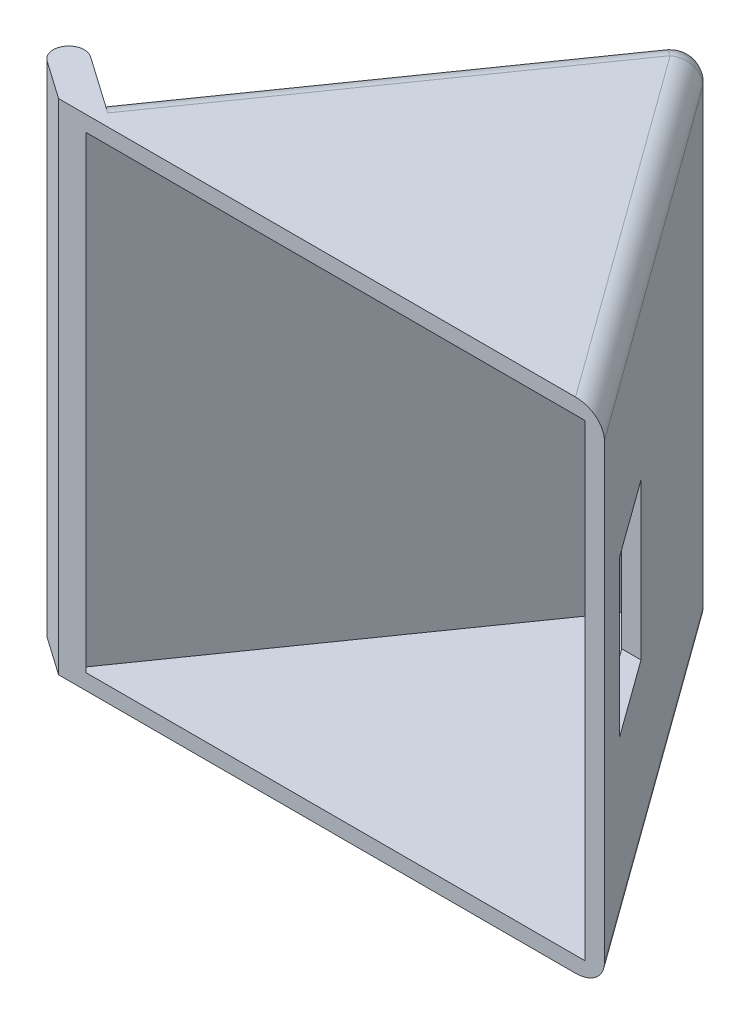
ISO-10303-21;
HEADER;
FILE_DESCRIPTION(('STEP AP214'),'2;1');
FILE_NAME('part.step','',(''),(''),'','','');
FILE_SCHEMA(('AUTOMOTIVE_DESIGN { 1 0 10303 214 1 1 1 1 }'));
ENDSEC;
DATA;
#1=APPLICATION_CONTEXT('core data for automotive mechanical design processes');
#2=APPLICATION_PROTOCOL_DEFINITION('international standard','automotive_design',2000,#1);
#3=PRODUCT_CONTEXT('',#1,'mechanical');
#4=PRODUCT('Part','Part','',(#3));
#5=PRODUCT_RELATED_PRODUCT_CATEGORY('part','',(#4));
#6=PRODUCT_DEFINITION_FORMATION('','',#4);
#7=PRODUCT_DEFINITION_CONTEXT('part definition',#1,'design');
#8=PRODUCT_DEFINITION('design','',#6,#7);
#9=PRODUCT_DEFINITION_SHAPE('','',#8);
#10=(LENGTH_UNIT() NAMED_UNIT(*) SI_UNIT(.MILLI.,.METRE.));
#11=(NAMED_UNIT(*) PLANE_ANGLE_UNIT() SI_UNIT($,.RADIAN.));
#12=(NAMED_UNIT(*) SI_UNIT($,.STERADIAN.) SOLID_ANGLE_UNIT());
#13=UNCERTAINTY_MEASURE_WITH_UNIT(LENGTH_MEASURE(1.E-05),#10,'distance_accuracy_value','');
#14=(GEOMETRIC_REPRESENTATION_CONTEXT(3) GLOBAL_UNCERTAINTY_ASSIGNED_CONTEXT((#13)) GLOBAL_UNIT_ASSIGNED_CONTEXT((#10,
#11,#12)) REPRESENTATION_CONTEXT('',''));
#15=CARTESIAN_POINT('',(0.,0.,0.));
#16=DIRECTION('',(0.,0.,1.));
#17=DIRECTION('',(1.,0.,0.));
#18=AXIS2_PLACEMENT_3D('',#15,#16,#17);
#19=CARTESIAN_POINT('',(35.,32.,0.));
#20=DIRECTION('',(-0.809983847848433,0.,0.586452185795778));
#21=DIRECTION('',(0.586452185795778,0.,0.809983847848434));
#22=AXIS2_PLACEMENT_3D('',#19,#20,#21);
#23=PLANE('',#22);
#24=DIRECTION('',(0.,-1.,0.));
#25=VECTOR('',#24,1.);
#26=CARTESIAN_POINT('',(35.,32.,0.));
#27=LINE('',#26,#25);
#28=CARTESIAN_POINT('',(35.,30.5,0.));
#29=VERTEX_POINT('',#28);
#30=CARTESIAN_POINT('',(35.,1.5,0.));
#31=VERTEX_POINT('',#30);
#32=EDGE_CURVE('E278',#29,#31,#27,.T.);
#33=ORIENTED_EDGE('',*,*,#32,.T.);
#34=DIRECTION('',(-0.586452185795778,0.,-0.809983847848434));
#35=VECTOR('',#34,1.);
#36=CARTESIAN_POINT('',(17.2072930905315,1.5,-24.5745613286697));
#37=LINE('',#36,#35);
#38=CARTESIAN_POINT('',(18.4427069673902,1.5,-22.868258052972));
#39=VERTEX_POINT('',#38);
#40=EDGE_CURVE('E394',#31,#39,#37,.T.);
#41=ORIENTED_EDGE('',*,*,#40,.T.);
#42=DIRECTION('',(0.,-1.,0.));
#43=VECTOR('',#42,1.);
#44=CARTESIAN_POINT('',(18.4427069673903,32.,-22.868258052972));
#45=LINE('',#44,#43);
#46=CARTESIAN_POINT('',(18.4427069673902,30.5,-22.868258052972));
#47=VERTEX_POINT('',#46);
#48=EDGE_CURVE('E390',#39,#47,#45,.F.);
#49=ORIENTED_EDGE('',*,*,#48,.T.);
#50=DIRECTION('',(-0.586452185795778,0.,-0.809983847848434));
#51=VECTOR('',#50,1.);
#52=CARTESIAN_POINT('',(35.,30.5,0.));
#53=LINE('',#52,#51);
#54=EDGE_CURVE('E392',#47,#29,#53,.F.);
#55=ORIENTED_EDGE('',*,*,#54,.T.);
#56=EDGE_LOOP('',(#33,#41,#49,#55));
#57=FACE_BOUND('',#56,.T.);
#58=DIRECTION('',(-0.586452185795778,0.,-0.809983847848434));
#59=VECTOR('',#58,1.);
#60=CARTESIAN_POINT('',(39.940453386454,21.,6.82355278230528));
#61=LINE('',#60,#59);
#62=CARTESIAN_POINT('',(32.4658968129581,21.,-3.5));
#63=VERTEX_POINT('',#62);
#64=CARTESIAN_POINT('',(28.8457494028981,21.,-8.50000000000001));
#65=VERTEX_POINT('',#64);
#66=EDGE_CURVE('E219',#63,#65,#61,.T.);
#67=ORIENTED_EDGE('',*,*,#66,.T.);
#68=DIRECTION('',(0.,-1.,0.));
#69=VECTOR('',#68,1.);
#70=CARTESIAN_POINT('',(28.8457494028981,32.,-8.5));
#71=LINE('',#70,#69);
#72=CARTESIAN_POINT('',(28.8457494028981,11.,-8.5));
#73=VERTEX_POINT('',#72);
#74=EDGE_CURVE('E222',#65,#73,#71,.T.);
#75=ORIENTED_EDGE('',*,*,#74,.T.);
#76=DIRECTION('',(0.586452185795778,0.,0.809983847848434));
#77=VECTOR('',#76,1.);
#78=CARTESIAN_POINT('',(39.940453386454,11.,6.82355278230527));
#79=LINE('',#78,#77);
#80=CARTESIAN_POINT('',(32.4658968129581,11.,-3.5));
#81=VERTEX_POINT('',#80);
#82=EDGE_CURVE('E190',#73,#81,#79,.T.);
#83=ORIENTED_EDGE('',*,*,#82,.T.);
#84=DIRECTION('',(0.,1.,0.));
#85=VECTOR('',#84,1.);
#86=CARTESIAN_POINT('',(32.4658968129581,32.,-3.5));
#87=LINE('',#86,#85);
#88=EDGE_CURVE('E247',#81,#63,#87,.T.);
#89=ORIENTED_EDGE('',*,*,#88,.T.);
#90=EDGE_LOOP('',(#67,#75,#83,#89));
#91=FACE_BOUND('',#90,.T.);
#92=ADVANCED_FACE('F35',(#57,#91),#23,.F.);
#93=CARTESIAN_POINT('',(34.1900161521516,32.,0.586452185795778));
#94=DIRECTION('',(-0.809983847848433,0.,0.586452185795778));
#95=DIRECTION('',(0.586452185795778,0.,0.809983847848434));
#96=AXIS2_PLACEMENT_3D('',#93,#94,#95);
#97=PLANE('',#96);
#98=DIRECTION('',(-0.586452185795778,0.,-0.809983847848434));
#99=VECTOR('',#98,1.);
#100=CARTESIAN_POINT('',(22.152600334289,1.,-16.0391357452538));
#101=LINE('',#100,#99);
#102=CARTESIAN_POINT('',(33.7654074798451,1.,0.));
#103=VERTEX_POINT('',#102);
#104=CARTESIAN_POINT('',(17.2209184939222,1.,-22.8505736257421));
#105=VERTEX_POINT('',#104);
#106=EDGE_CURVE('E231',#103,#105,#101,.T.);
#107=ORIENTED_EDGE('',*,*,#106,.F.);
#108=DIRECTION('',(0.,-1.,0.));
#109=VECTOR('',#108,1.);
#110=CARTESIAN_POINT('',(33.7654074798451,32.,0.));
#111=LINE('',#110,#109);
#112=CARTESIAN_POINT('',(33.7654074798451,31.,0.));
#113=VERTEX_POINT('',#112);
#114=EDGE_CURVE('E235',#113,#103,#111,.T.);
#115=ORIENTED_EDGE('',*,*,#114,.F.);
#116=DIRECTION('',(-0.586452185795778,0.,-0.809983847848434));
#117=VECTOR('',#116,1.);
#118=CARTESIAN_POINT('',(22.152600334289,31.,-16.0391357452538));
#119=LINE('',#118,#117);
#120=CARTESIAN_POINT('',(17.2209184939222,31.,-22.8505736257421));
#121=VERTEX_POINT('',#120);
#122=EDGE_CURVE('E236',#113,#121,#119,.T.);
#123=ORIENTED_EDGE('',*,*,#122,.T.);
#124=DIRECTION('',(0.,-1.,0.));
#125=VECTOR('',#124,1.);
#126=CARTESIAN_POINT('',(17.2209184939222,32.,-22.8505736257421));
#127=LINE('',#126,#125);
#128=EDGE_CURVE('E232',#121,#105,#127,.T.);
#129=ORIENTED_EDGE('',*,*,#128,.T.);
#130=EDGE_LOOP('',(#107,#115,#123,#129));
#131=FACE_BOUND('',#130,.T.);
#132=DIRECTION('',(0.,1.,0.));
#133=VECTOR('',#132,1.);
#134=CARTESIAN_POINT('',(27.6111568827432,32.,-8.5));
#135=LINE('',#134,#133);
#136=CARTESIAN_POINT('',(27.6111568827432,11.,-8.5));
#137=VERTEX_POINT('',#136);
#138=CARTESIAN_POINT('',(27.6111568827432,21.,-8.50000000000001));
#139=VERTEX_POINT('',#138);
#140=EDGE_CURVE('E197',#137,#139,#135,.T.);
#141=ORIENTED_EDGE('',*,*,#140,.T.);
#142=DIRECTION('',(0.586452185795778,0.,0.809983847848434));
#143=VECTOR('',#142,1.);
#144=CARTESIAN_POINT('',(34.1900161521516,21.,0.586452185795783));
#145=LINE('',#144,#143);
#146=CARTESIAN_POINT('',(31.2313042928031,21.,-3.50000000000001));
#147=VERTEX_POINT('',#146);
#148=EDGE_CURVE('E203',#139,#147,#145,.T.);
#149=ORIENTED_EDGE('',*,*,#148,.T.);
#150=DIRECTION('',(0.,-1.,0.));
#151=VECTOR('',#150,1.);
#152=CARTESIAN_POINT('',(31.2313042928031,32.,-3.5));
#153=LINE('',#152,#151);
#154=CARTESIAN_POINT('',(31.2313042928031,11.,-3.5));
#155=VERTEX_POINT('',#154);
#156=EDGE_CURVE('E208',#147,#155,#153,.T.);
#157=ORIENTED_EDGE('',*,*,#156,.T.);
#158=DIRECTION('',(-0.586452185795778,0.,-0.809983847848434));
#159=VECTOR('',#158,1.);
#160=CARTESIAN_POINT('',(34.1900161521516,11.,0.586452185795778));
#161=LINE('',#160,#159);
#162=EDGE_CURVE('E187',#155,#137,#161,.T.);
#163=ORIENTED_EDGE('',*,*,#162,.T.);
#164=EDGE_LOOP('',(#141,#149,#157,#163));
#165=FACE_BOUND('',#164,.T.);
#166=ADVANCED_FACE('F206',(#131,#165),#97,.T.);
#167=CARTESIAN_POINT('',(0.,32.,0.));
#168=DIRECTION('',(0.,0.,-1.));
#169=DIRECTION('',(-1.,0.,0.));
#170=AXIS2_PLACEMENT_3D('',#167,#168,#169);
#171=PLANE('',#170);
#172=DIRECTION('',(1.,0.,0.));
#173=VECTOR('',#172,1.);
#174=CARTESIAN_POINT('',(0.,0.,0.));
#175=LINE('',#174,#173);
#176=CARTESIAN_POINT('',(0.,0.,0.));
#177=VERTEX_POINT('',#176);
#178=CARTESIAN_POINT('',(33.1481112197676,0.,0.));
#179=VERTEX_POINT('',#178);
#180=EDGE_CURVE('E275',#177,#179,#175,.T.);
#181=ORIENTED_EDGE('',*,*,#180,.T.);
#182=CARTESIAN_POINT('',(33.1481112197676,1.5,0.));
#183=DIRECTION('',(0.,0.,-1.));
#184=DIRECTION('',(1.,0.,0.));
#185=AXIS2_PLACEMENT_3D('',#182,#183,#184);
#186=ELLIPSE('',#185,1.85188878023242,1.5);
#187=EDGE_CURVE('E398',#179,#31,#186,.F.);
#188=ORIENTED_EDGE('',*,*,#187,.T.);
#189=ORIENTED_EDGE('',*,*,#32,.F.);
#190=CARTESIAN_POINT('',(33.1481112197676,30.5,0.));
#191=DIRECTION('',(0.,0.,-1.));
#192=DIRECTION('',(-1.,0.,0.));
#193=AXIS2_PLACEMENT_3D('',#190,#191,#192);
#194=ELLIPSE('',#193,1.85188878023242,1.5);
#195=CARTESIAN_POINT('',(33.1481112197676,32.,0.));
#196=VERTEX_POINT('',#195);
#197=EDGE_CURVE('E396',#29,#196,#194,.F.);
#198=ORIENTED_EDGE('',*,*,#197,.T.);
#199=DIRECTION('',(1.,0.,0.));
#200=VECTOR('',#199,1.);
#201=CARTESIAN_POINT('',(0.,32.,0.));
#202=LINE('',#201,#200);
#203=CARTESIAN_POINT('',(0.,32.,0.));
#204=VERTEX_POINT('',#203);
#205=EDGE_CURVE('E276',#204,#196,#202,.T.);
#206=ORIENTED_EDGE('',*,*,#205,.F.);
#207=DIRECTION('',(0.,-1.,0.));
#208=VECTOR('',#207,1.);
#209=CARTESIAN_POINT('',(0.,32.,0.));
#210=LINE('',#209,#208);
#211=EDGE_CURVE('E283',#204,#177,#210,.T.);
#212=ORIENTED_EDGE('',*,*,#211,.T.);
#213=EDGE_LOOP('',(#181,#188,#189,#198,#206,#212));
#214=FACE_BOUND('',#213,.T.);
#215=DIRECTION('',(1.,0.,0.));
#216=VECTOR('',#215,1.);
#217=CARTESIAN_POINT('',(0.,1.,0.));
#218=LINE('',#217,#216);
#219=CARTESIAN_POINT('',(1.74344679562108,1.,0.));
#220=VERTEX_POINT('',#219);
#221=EDGE_CURVE('E239',#220,#103,#218,.T.);
#222=ORIENTED_EDGE('',*,*,#221,.F.);
#223=DIRECTION('',(0.,-1.,0.));
#224=VECTOR('',#223,1.);
#225=CARTESIAN_POINT('',(1.74344679562108,32.,0.));
#226=LINE('',#225,#224);
#227=CARTESIAN_POINT('',(1.74344679562108,31.,0.));
#228=VERTEX_POINT('',#227);
#229=EDGE_CURVE('E250',#228,#220,#226,.T.);
#230=ORIENTED_EDGE('',*,*,#229,.F.);
#231=DIRECTION('',(1.,0.,0.));
#232=VECTOR('',#231,1.);
#233=CARTESIAN_POINT('',(0.,31.,0.));
#234=LINE('',#233,#232);
#235=EDGE_CURVE('E230',#228,#113,#234,.T.);
#236=ORIENTED_EDGE('',*,*,#235,.T.);
#237=ORIENTED_EDGE('',*,*,#114,.T.);
#238=EDGE_LOOP('',(#222,#230,#236,#237));
#239=FACE_BOUND('',#238,.T.);
#240=ADVANCED_FACE('F340',(#214,#239),#171,.F.);
#241=CARTESIAN_POINT('',(-2.12945530445384,32.,-3.93260983398219));
#242=DIRECTION('',(-0.573576436351053,0.,0.819152044288987));
#243=DIRECTION('',(0.819152044288987,0.,0.573576436351053));
#244=AXIS2_PLACEMENT_3D('',#241,#242,#243);
#245=PLANE('',#244);
#246=DIRECTION('',(-0.819152044288987,0.,-0.573576436351053));
#247=VECTOR('',#246,1.);
#248=CARTESIAN_POINT('',(2.97883252764019,17.,-0.355748186604935));
#249=LINE('',#248,#247);
#250=CARTESIAN_POINT('',(1.1471528727021,17.,-1.63830408857797));
#251=VERTEX_POINT('',#250);
#252=CARTESIAN_POINT('',(-1.31030326016486,17.,-3.35903339763113));
#253=VERTEX_POINT('',#252);
#254=EDGE_CURVE('E259',#251,#253,#249,.T.);
#255=ORIENTED_EDGE('',*,*,#254,.T.);
#256=DIRECTION('',(0.,-1.,0.));
#257=VECTOR('',#256,1.);
#258=CARTESIAN_POINT('',(-1.31030326016486,32.,-3.35903339763113));
#259=LINE('',#258,#257);
#260=CARTESIAN_POINT('',(-1.31030326016486,32.,-3.35903339763113));
#261=VERTEX_POINT('',#260);
#262=EDGE_CURVE('E364',#253,#261,#259,.F.);
#263=ORIENTED_EDGE('',*,*,#262,.T.);
#264=DIRECTION('',(-0.819152044288987,0.,-0.573576436351053));
#265=VECTOR('',#264,1.);
#266=CARTESIAN_POINT('',(-2.12945530445384,32.,-3.93260983398219));
#267=LINE('',#266,#265);
#268=CARTESIAN_POINT('',(2.37588093913558,32.,-0.777939434051399));
#269=VERTEX_POINT('',#268);
#270=EDGE_CURVE('E59',#269,#261,#267,.T.);
#271=ORIENTED_EDGE('',*,*,#270,.F.);
#272=CARTESIAN_POINT('',(2.37588093913558,30.5,-0.777939434051399));
#273=DIRECTION('',(-0.573576436351053,0.,0.819152044288987));
#274=DIRECTION('',(0.819152044288987,0.,0.573576436351053));
#275=AXIS2_PLACEMENT_3D('',#272,#273,#274);
#276=CIRCLE('',#275,1.5);
#277=CARTESIAN_POINT('',(1.1471528727021,30.5,-1.63830408857798));
#278=VERTEX_POINT('',#277);
#279=EDGE_CURVE('E11',#269,#278,#276,.T.);
#280=ORIENTED_EDGE('',*,*,#279,.T.);
#281=DIRECTION('',(0.,-1.,0.));
#282=VECTOR('',#281,1.);
#283=CARTESIAN_POINT('',(1.1471528727021,32.,-1.63830408857798));
#284=LINE('',#283,#282);
#285=EDGE_CURVE('E273',#278,#251,#284,.T.);
#286=ORIENTED_EDGE('',*,*,#285,.T.);
#287=EDGE_LOOP('',(#255,#263,#271,#280,#286));
#288=FACE_BOUND('',#287,.T.);
#289=ADVANCED_FACE('F329',(#288),#245,.F.);
#290=CARTESIAN_POINT('',(17.2072930905315,32.,-24.5745613286697));
#291=DIRECTION('',(0.819152044288989,0.,0.57357643635105));
#292=DIRECTION('',(0.57357643635105,0.,-0.819152044288989));
#293=AXIS2_PLACEMENT_3D('',#290,#291,#292);
#294=PLANE('',#293);
#295=CARTESIAN_POINT('',(14.9129873451273,16.,-21.2979531515137));
#296=DIRECTION('',(-0.819152044288989,0.,-0.57357643635105));
#297=DIRECTION('',(-0.57357643635105,0.,0.819152044288989));
#298=AXIS2_PLACEMENT_3D('',#295,#296,#297);
#299=CIRCLE('',#298,1.);
#300=CARTESIAN_POINT('',(14.3394109087763,16.,-20.4788011072247));
#301=VERTEX_POINT('',#300);
#302=EDGE_CURVE('E210',#301,#301,#299,.T.);
#303=ORIENTED_EDGE('',*,*,#302,.F.);
#304=EDGE_LOOP('',(#303));
#305=FACE_BOUND('',#304,.T.);
#306=DIRECTION('',(0.,-1.,0.));
#307=VECTOR('',#306,1.);
#308=CARTESIAN_POINT('',(15.9990031291841,32.,-22.8489444288049));
#309=LINE('',#308,#307);
#310=CARTESIAN_POINT('',(15.9990031291841,30.5,-22.8489444288049));
#311=VERTEX_POINT('',#310);
#312=CARTESIAN_POINT('',(15.9990031291841,1.5,-22.8489444288049));
#313=VERTEX_POINT('',#312);
#314=EDGE_CURVE('E379',#311,#313,#309,.T.);
#315=ORIENTED_EDGE('',*,*,#314,.T.);
#316=DIRECTION('',(-0.57357643635105,0.,0.819152044288989));
#317=VECTOR('',#316,1.);
#318=CARTESIAN_POINT('',(1.1471528727021,1.5,-1.63830408857798));
#319=LINE('',#318,#317);
#320=CARTESIAN_POINT('',(1.1471528727021,1.5,-1.63830408857798));
#321=VERTEX_POINT('',#320);
#322=EDGE_CURVE('E383',#313,#321,#319,.T.);
#323=ORIENTED_EDGE('',*,*,#322,.T.);
#324=CARTESIAN_POINT('',(1.1471528727021,15.,-1.63830408857797));
#325=VERTEX_POINT('',#324);
#326=EDGE_CURVE('E269',#325,#321,#284,.T.);
#327=ORIENTED_EDGE('',*,*,#326,.F.);
#328=CARTESIAN_POINT('',(1.1471528727021,16.,-1.63830408857798));
#329=DIRECTION('',(0.819152044288989,0.,0.57357643635105));
#330=DIRECTION('',(0.57357643635105,0.,-0.819152044288989));
#331=AXIS2_PLACEMENT_3D('',#328,#329,#330);
#332=CIRCLE('',#331,1.);
#333=EDGE_CURVE('E256',#325,#251,#332,.F.);
#334=ORIENTED_EDGE('',*,*,#333,.T.);
#335=ORIENTED_EDGE('',*,*,#285,.F.);
#336=DIRECTION('',(-0.57357643635105,0.,0.819152044288989));
#337=VECTOR('',#336,1.);
#338=CARTESIAN_POINT('',(17.2072930905315,30.5,-24.5745613286697));
#339=LINE('',#338,#337);
#340=EDGE_CURVE('E381',#278,#311,#339,.F.);
#341=ORIENTED_EDGE('',*,*,#340,.T.);
#342=EDGE_LOOP('',(#315,#323,#327,#334,#335,#341));
#343=FACE_BOUND('',#342,.T.);
#344=ADVANCED_FACE('F333',(#305,#343),#294,.F.);
#345=CARTESIAN_POINT('',(0.,32.,0.));
#346=DIRECTION('',(0.,-1.,0.));
#347=DIRECTION('',(0.,0.,-1.));
#348=AXIS2_PLACEMENT_3D('',#345,#346,#347);
#349=PLANE('',#348);
#350=ORIENTED_EDGE('',*,*,#205,.T.);
#351=DIRECTION('',(-0.586452185795778,0.,-0.809983847848434));
#352=VECTOR('',#351,1.);
#353=CARTESIAN_POINT('',(21.7476084103648,32.,-15.7459096523559));
#354=LINE('',#353,#352);
#355=CARTESIAN_POINT('',(17.2277311956176,32.,-21.9885797742783));
#356=VERTEX_POINT('',#355);
#357=EDGE_CURVE('E52',#196,#356,#354,.T.);
#358=ORIENTED_EDGE('',*,*,#357,.T.);
#359=DIRECTION('',(-0.57357643635105,0.,0.819152044288989));
#360=VECTOR('',#359,1.);
#361=CARTESIAN_POINT('',(1.22872806643348,32.,0.860364654526575));
#362=LINE('',#361,#360);
#363=EDGE_CURVE('E400',#356,#269,#362,.T.);
#364=ORIENTED_EDGE('',*,*,#363,.T.);
#365=ORIENTED_EDGE('',*,*,#270,.T.);
#366=CARTESIAN_POINT('',(-1.88387969651591,32.,-2.53988135334215));
#367=DIRECTION('',(0.,-1.,0.));
#368=DIRECTION('',(0.,0.,-1.));
#369=AXIS2_PLACEMENT_3D('',#366,#367,#368);
#370=CIRCLE('',#369,1.);
#371=CARTESIAN_POINT('',(-2.70303174080489,32.,-3.1134577896932));
#372=VERTEX_POINT('',#371);
#373=EDGE_CURVE('E363',#261,#372,#370,.F.);
#374=ORIENTED_EDGE('',*,*,#373,.T.);
#375=CARTESIAN_POINT('',(-1.88387969651591,32.,-2.53988135334215));
#376=DIRECTION('',(0.,-1.,0.));
#377=DIRECTION('',(0.,0.,-1.));
#378=AXIS2_PLACEMENT_3D('',#375,#376,#377);
#379=CIRCLE('',#378,1.);
#380=CARTESIAN_POINT('',(-2.45745613286696,32.,-1.72072930905316));
#381=VERTEX_POINT('',#380);
#382=EDGE_CURVE('E377',#372,#381,#379,.F.);
#383=ORIENTED_EDGE('',*,*,#382,.T.);
#384=DIRECTION('',(0.819152044288987,0.,0.573576436351053));
#385=VECTOR('',#384,1.);
#386=CARTESIAN_POINT('',(0.,32.,0.));
#387=LINE('',#386,#385);
#388=EDGE_CURVE('E266',#381,#204,#387,.T.);
#389=ORIENTED_EDGE('',*,*,#388,.T.);
#390=EDGE_LOOP('',(#350,#358,#364,#365,#374,#383,#389));
#391=FACE_BOUND('',#390,.T.);
#392=ADVANCED_FACE('F330',(#391),#349,.F.);
#393=CARTESIAN_POINT('',(0.,0.,0.));
#394=DIRECTION('',(0.,-1.,0.));
#395=DIRECTION('',(0.,0.,-1.));
#396=AXIS2_PLACEMENT_3D('',#393,#394,#395);
#397=PLANE('',#396);
#398=DIRECTION('',(-0.819152044288987,0.,-0.573576436351053));
#399=VECTOR('',#398,1.);
#400=CARTESIAN_POINT('',(-2.12945530445384,0.,-3.93260983398219));
#401=LINE('',#400,#399);
#402=CARTESIAN_POINT('',(2.37588093913558,0.,-0.777939434051399));
#403=VERTEX_POINT('',#402);
#404=CARTESIAN_POINT('',(-1.31030326016486,0.,-3.35903339763113));
#405=VERTEX_POINT('',#404);
#406=EDGE_CURVE('E264',#403,#405,#401,.T.);
#407=ORIENTED_EDGE('',*,*,#406,.F.);
#408=DIRECTION('',(-0.57357643635105,0.,0.819152044288989));
#409=VECTOR('',#408,1.);
#410=CARTESIAN_POINT('',(18.436021156965,0.,-23.7141966741431));
#411=LINE('',#410,#409);
#412=CARTESIAN_POINT('',(17.2277311956176,0.,-21.9885797742783));
#413=VERTEX_POINT('',#412);
#414=EDGE_CURVE('E388',#403,#413,#411,.F.);
#415=ORIENTED_EDGE('',*,*,#414,.T.);
#416=DIRECTION('',(-0.586452185795778,0.,-0.809983847848434));
#417=VECTOR('',#416,1.);
#418=CARTESIAN_POINT('',(33.7850242282274,0.,0.879678278693668));
#419=LINE('',#418,#417);
#420=EDGE_CURVE('E386',#413,#179,#419,.F.);
#421=ORIENTED_EDGE('',*,*,#420,.T.);
#422=ORIENTED_EDGE('',*,*,#180,.F.);
#423=DIRECTION('',(0.819152044288987,0.,0.573576436351053));
#424=VECTOR('',#423,1.);
#425=CARTESIAN_POINT('',(0.,0.,0.));
#426=LINE('',#425,#424);
#427=CARTESIAN_POINT('',(-2.45745613286696,0.,-1.72072930905316));
#428=VERTEX_POINT('',#427);
#429=EDGE_CURVE('E267',#428,#177,#426,.T.);
#430=ORIENTED_EDGE('',*,*,#429,.F.);
#431=CARTESIAN_POINT('',(-1.88387969651591,0.,-2.53988135334215));
#432=DIRECTION('',(0.,-1.,0.));
#433=DIRECTION('',(0.,0.,-1.));
#434=AXIS2_PLACEMENT_3D('',#431,#432,#433);
#435=CIRCLE('',#434,1.);
#436=CARTESIAN_POINT('',(-2.70303174080489,0.,-3.1134577896932));
#437=VERTEX_POINT('',#436);
#438=EDGE_CURVE('E375',#428,#437,#435,.T.);
#439=ORIENTED_EDGE('',*,*,#438,.T.);
#440=CARTESIAN_POINT('',(-1.88387969651591,0.,-2.53988135334215));
#441=DIRECTION('',(0.,-1.,0.));
#442=DIRECTION('',(0.,0.,-1.));
#443=AXIS2_PLACEMENT_3D('',#440,#441,#442);
#444=CIRCLE('',#443,1.);
#445=EDGE_CURVE('E366',#437,#405,#444,.T.);
#446=ORIENTED_EDGE('',*,*,#445,.T.);
#447=EDGE_LOOP('',(#407,#415,#421,#422,#430,#439,#446));
#448=FACE_BOUND('',#447,.T.);
#449=ADVANCED_FACE('F327',(#448),#397,.T.);
#450=ORIENTED_EDGE('',*,*,#406,.T.);
#451=DIRECTION('',(0.,-1.,0.));
#452=VECTOR('',#451,1.);
#453=CARTESIAN_POINT('',(-1.31030326016486,32.,-3.35903339763113));
#454=LINE('',#453,#452);
#455=CARTESIAN_POINT('',(-1.31030326016486,15.,-3.35903339763113));
#456=VERTEX_POINT('',#455);
#457=EDGE_CURVE('E368',#405,#456,#454,.F.);
#458=ORIENTED_EDGE('',*,*,#457,.T.);
#459=DIRECTION('',(-0.819152044288987,0.,-0.573576436351053));
#460=VECTOR('',#459,1.);
#461=CARTESIAN_POINT('',(2.97883252764019,15.,-0.355748186604935));
#462=LINE('',#461,#460);
#463=EDGE_CURVE('E254',#325,#456,#462,.T.);
#464=ORIENTED_EDGE('',*,*,#463,.F.);
#465=ORIENTED_EDGE('',*,*,#326,.T.);
#466=CARTESIAN_POINT('',(2.37588093913558,1.5,-0.777939434051401));
#467=DIRECTION('',(-0.573576436351053,0.,0.819152044288987));
#468=DIRECTION('',(0.819152044288987,0.,0.573576436351053));
#469=AXIS2_PLACEMENT_3D('',#466,#467,#468);
#470=CIRCLE('',#469,1.5);
#471=EDGE_CURVE('E44',#321,#403,#470,.T.);
#472=ORIENTED_EDGE('',*,*,#471,.T.);
#473=EDGE_LOOP('',(#450,#458,#464,#465,#472));
#474=FACE_BOUND('',#473,.T.);
#475=ADVANCED_FACE('F323',(#474),#245,.F.);
#476=CARTESIAN_POINT('',(0.,32.,0.));
#477=DIRECTION('',(0.573576436351053,0.,-0.819152044288987));
#478=DIRECTION('',(-0.819152044288987,0.,-0.573576436351053));
#479=AXIS2_PLACEMENT_3D('',#476,#477,#478);
#480=PLANE('',#479);
#481=ORIENTED_EDGE('',*,*,#388,.F.);
#482=DIRECTION('',(0.,-1.,0.));
#483=VECTOR('',#482,1.);
#484=CARTESIAN_POINT('',(-2.45745613286696,32.,-1.72072930905316));
#485=LINE('',#484,#483);
#486=EDGE_CURVE('E372',#381,#428,#485,.T.);
#487=ORIENTED_EDGE('',*,*,#486,.T.);
#488=ORIENTED_EDGE('',*,*,#429,.T.);
#489=ORIENTED_EDGE('',*,*,#211,.F.);
#490=EDGE_LOOP('',(#481,#487,#488,#489));
#491=FACE_BOUND('',#490,.T.);
#492=ADVANCED_FACE('F317',(#491),#480,.F.);
#493=CARTESIAN_POINT('',(2.9788325276402,16.,-0.355748186604938));
#494=DIRECTION('',(-0.819152044288987,0.,-0.573576436351053));
#495=DIRECTION('',(-0.573576436351053,0.,0.819152044288987));
#496=AXIS2_PLACEMENT_3D('',#493,#494,#495);
#497=CYLINDRICAL_SURFACE('',#496,1.);
#498=CARTESIAN_POINT('',(-1.31030326016486,15.,-3.35903339763113));
#499=CARTESIAN_POINT('',(-1.33310550711178,15.0000084726861,-3.37500282200134));
#500=CARTESIAN_POINT('',(-1.35657637251984,15.00000021537,-3.39001508960939));
#501=CARTESIAN_POINT('',(-1.40468719113877,15.0000119302077,-3.41803177932073));
#502=CARTESIAN_POINT('',(-1.42932713723116,15.0000319021896,-3.43103621364757));
#503=CARTESIAN_POINT('',(-1.47965246595902,15.000161877896,-3.45496492544329));
#504=CARTESIAN_POINT('',(-1.50533961104606,15.0002720399026,-3.46588550419685));
#505=CARTESIAN_POINT('',(-1.55752665630268,15.0007051556566,-3.48554108292495));
#506=CARTESIAN_POINT('',(-1.58402654595227,15.0010281066508,-3.49427611117542));
#507=CARTESIAN_POINT('',(-1.66452940311665,15.0025463105821,-3.51711787557564));
#508=CARTESIAN_POINT('',(-1.71952649529518,15.0042909948775,-3.52785699114539));
#509=CARTESIAN_POINT('',(-1.83031010061858,15.0109521102541,-3.53999767943296));
#510=CARTESIAN_POINT('',(-1.88609584585694,15.0158656393623,-3.54140778221018));
#511=CARTESIAN_POINT('',(-1.9943166929152,15.0306663007788,-3.5351809721169));
#512=CARTESIAN_POINT('',(-2.04679758569917,15.0403518073493,-3.52789505127447));
#513=CARTESIAN_POINT('',(-2.14835355787017,15.0664010018036,-3.50566813657277));
#514=CARTESIAN_POINT('',(-2.1974337447676,15.082754409152,-3.4907389180929));
#515=CARTESIAN_POINT('',(-2.28361138106778,15.1205265775903,-3.45751688712231));
#516=CARTESIAN_POINT('',(-2.32143050845834,15.1409526814356,-3.43995866608425));
#517=CARTESIAN_POINT('',(-2.39171932631304,15.1877558294031,-3.40225600100022));
#518=CARTESIAN_POINT('',(-2.42418878399193,15.2141331323671,-3.38211144448041));
#519=CARTESIAN_POINT('',(-2.481524438486,15.2706641697465,-3.34235938750421));
#520=CARTESIAN_POINT('',(-2.50672196340715,15.3005109096799,-3.32278830106969));
#521=CARTESIAN_POINT('',(-2.55196416085023,15.3643811864625,-3.28455686710211));
#522=CARTESIAN_POINT('',(-2.57200759223279,15.3984057264442,-3.26589673980875));
#523=CARTESIAN_POINT('',(-2.60905013168161,15.4734075698069,-3.22899646799235));
#524=CARTESIAN_POINT('',(-2.62555229846989,15.5147396942126,-3.2109802661849));
#525=CARTESIAN_POINT('',(-2.65342605759434,15.6005374802068,-3.17882719034967));
#526=CARTESIAN_POINT('',(-2.66479336859886,15.645005721042,-3.16469355735678));
#527=CARTESIAN_POINT('',(-2.68385471601058,15.7404323667975,-3.14013797780963));
#528=CARTESIAN_POINT('',(-2.69109920108987,15.7916066781811,-3.13019400460062));
#529=CARTESIAN_POINT('',(-2.69828757226715,15.8692769087492,-3.12018665251485));
#530=CARTESIAN_POINT('',(-2.70007062650894,15.8953230973099,-3.11766895895148));
#531=CARTESIAN_POINT('',(-2.70244047454774,15.9475756022013,-3.11430330094861));
#532=CARTESIAN_POINT('',(-2.70302734645708,15.9737819079639,-3.11345522748079));
#533=CARTESIAN_POINT('',(-2.7030317408049,16.,-3.1134577896932));
#534=B_SPLINE_CURVE_WITH_KNOTS('',3,(#498,#499,#500,#501,#502,#503,#504,#505,#506,#507,#508,
#509,#510,#511,#512,#513,#514,#515,#516,#517,#518,#519,#520,#521,#522,#523,#524,#525,#526,#527,
#528,#529,#530,#531,#532,#533),.UNSPECIFIED.,.F.,.F.,(4,2,2,2,2,2,2,2,2,2,2,2,2,2,2,2,2,4),(0.,
0.0834878347281737,0.166975161167903,0.250609321497255,0.334242399739241,0.50153827508288,
0.668681160903593,0.829299803909303,0.989671736729569,1.12821123604275,1.26675676216527,
1.39728229603103,1.52783923192528,1.671304684928,1.81488953652532,1.97206569111012,
2.05068136863726,2.12929191228916),.UNSPECIFIED.);
#535=CARTESIAN_POINT('',(-2.7030317408049,16.,-3.1134577896932));
#536=VERTEX_POINT('',#535);
#537=EDGE_CURVE('E292',#456,#536,#534,.T.);
#538=ORIENTED_EDGE('',*,*,#537,.T.);
#539=CARTESIAN_POINT('',(-2.70303174080489,16.,-3.1134577896932));
#540=CARTESIAN_POINT('',(-2.70302626591719,16.0278381927218,-3.1134508369657));
#541=CARTESIAN_POINT('',(-2.70236481013221,16.0556750830582,-3.11440988991785));
#542=CARTESIAN_POINT('',(-2.69969077741958,16.1111548715253,-3.11820838021012));
#543=CARTESIAN_POINT('',(-2.69767820871779,16.138797770836,-3.1210478061021));
#544=CARTESIAN_POINT('',(-2.69225802951019,16.1937468119812,-3.1285620185049));
#545=CARTESIAN_POINT('',(-2.68884797169065,16.2210522760356,-3.1332400241854));
#546=CARTESIAN_POINT('',(-2.68055927290026,16.2750753776442,-3.1443223985679));
#547=CARTESIAN_POINT('',(-2.675680650931,16.3017930227994,-3.15072674493284));
#548=CARTESIAN_POINT('',(-2.65868450059395,16.3808386006414,-3.17235285537999));
#549=CARTESIAN_POINT('',(-2.64420758329949,16.4320492847674,-3.18998627171365));
#550=CARTESIAN_POINT('',(-2.60800868424276,16.5297615142646,-3.23007035698915));
#551=CARTESIAN_POINT('',(-2.58629334008808,16.5762673232447,-3.25251660588055));
#552=CARTESIAN_POINT('',(-2.53564013556573,16.661345099804,-3.29905271323444));
#553=CARTESIAN_POINT('',(-2.50701728487684,16.7001558979018,-3.32304421499877));
#554=CARTESIAN_POINT('',(-2.44182490811678,16.7705968455897,-3.37073319332362));
#555=CARTESIAN_POINT('',(-2.40526765566626,16.8022379330876,-3.39443106490373));
#556=CARTESIAN_POINT('',(-2.33036568360688,16.8537751459025,-3.43554840097404));
#557=CARTESIAN_POINT('',(-2.29294182150335,16.874683779566,-3.45338338974567));
#558=CARTESIAN_POINT('',(-2.21376415593598,16.9106356481225,-3.4848620166553));
#559=CARTESIAN_POINT('',(-2.17201016417988,16.9256786278166,-3.49850547242547));
#560=CARTESIAN_POINT('',(-2.08816243918084,16.949844403228,-3.51969357778055));
#561=CARTESIAN_POINT('',(-2.04622828647929,16.9592594932656,-3.52754555127903));
#562=CARTESIAN_POINT('',(-1.96106169319821,16.9743910821375,-3.53782162232236));
#563=CARTESIAN_POINT('',(-1.91782894270176,16.9801066906143,-3.54024441356623));
#564=CARTESIAN_POINT('',(-1.82686695042167,16.9892850361206,-3.53938987805403));
#565=CARTESIAN_POINT('',(-1.77911576360433,16.9924691509512,-3.53552528047547));
#566=CARTESIAN_POINT('',(-1.68455714174592,16.9968597510647,-3.5209851127399));
#567=CARTESIAN_POINT('',(-1.63775052521288,16.9980645882673,-3.5103038768528));
#568=CARTESIAN_POINT('',(-1.54177325349387,16.9995942281573,-3.48100234639162));
#569=CARTESIAN_POINT('',(-1.49279820995887,16.9998249342035,-3.46172626799624));
#570=CARTESIAN_POINT('',(-1.42210766263587,16.9999733218018,-3.42726891765205));
#571=CARTESIAN_POINT('',(-1.39900233811174,16.9999898246271,-3.41485659683198));
#572=CARTESIAN_POINT('',(-1.35383859377962,17.0000006283695,-3.3882576460609));
#573=CARTESIAN_POINT('',(-1.33178010570369,16.9999949307363,-3.37407113203134));
#574=CARTESIAN_POINT('',(-1.31030326016485,17.,-3.35903339763113));
#575=B_SPLINE_CURVE_WITH_KNOTS('',3,(#539,#540,#541,#542,#543,#544,#545,#546,#547,#548,#549,
#550,#551,#552,#553,#554,#555,#556,#557,#558,#559,#560,#561,#562,#563,#564,#565,#566,#567,#568,
#569,#570,#571,#572,#573,#574),.UNSPECIFIED.,.F.,.F.,(4,2,2,2,2,2,2,2,2,2,2,2,2,2,2,2,2,4),(0.,
0.083487834728174,0.166975161167903,0.250609321497249,0.334242399739241,0.501538275082879,
0.668681160903592,0.829299803909305,0.989671736729567,1.12821123604275,1.26675676216527,
1.39728229603103,1.52783923192528,1.671304684928,1.81488953652532,1.97206569111011,
2.05068136863726,2.12929191228916),.UNSPECIFIED.);
#576=EDGE_CURVE('E301',#536,#253,#575,.T.);
#577=ORIENTED_EDGE('',*,*,#576,.T.);
#578=ORIENTED_EDGE('',*,*,#254,.F.);
#579=ORIENTED_EDGE('',*,*,#333,.F.);
#580=ORIENTED_EDGE('',*,*,#463,.T.);
#581=EDGE_LOOP('',(#538,#577,#578,#579,#580));
#582=FACE_BOUND('',#581,.T.);
#583=ADVANCED_FACE('F311',(#582),#497,.F.);
#584=CARTESIAN_POINT('',(0.573576436351053,32.,-0.819152044288987));
#585=DIRECTION('',(0.573576436351053,0.,-0.819152044288987));
#586=DIRECTION('',(-0.819152044288987,0.,-0.573576436351053));
#587=AXIS2_PLACEMENT_3D('',#584,#585,#586);
#588=PLANE('',#587);
#589=DIRECTION('',(0.,-1.,0.));
#590=VECTOR('',#589,1.);
#591=CARTESIAN_POINT('',(1.39272848064004,32.,-0.245575607937937));
#592=LINE('',#591,#590);
#593=CARTESIAN_POINT('',(1.39272848064004,31.,-0.245575607937936));
#594=VERTEX_POINT('',#593);
#595=CARTESIAN_POINT('',(1.39272848064004,1.,-0.245575607937934));
#596=VERTEX_POINT('',#595);
#597=EDGE_CURVE('E223',#594,#596,#592,.T.);
#598=ORIENTED_EDGE('',*,*,#597,.F.);
#599=DIRECTION('',(0.819152044288987,0.,0.573576436351053));
#600=VECTOR('',#599,1.);
#601=CARTESIAN_POINT('',(0.573576436351053,31.,-0.819152044288987));
#602=LINE('',#601,#600);
#603=EDGE_CURVE('E226',#594,#228,#602,.T.);
#604=ORIENTED_EDGE('',*,*,#603,.T.);
#605=ORIENTED_EDGE('',*,*,#229,.T.);
#606=DIRECTION('',(0.819152044288987,0.,0.573576436351053));
#607=VECTOR('',#606,1.);
#608=CARTESIAN_POINT('',(0.573576436351053,1.,-0.819152044288987));
#609=LINE('',#608,#607);
#610=EDGE_CURVE('E244',#596,#220,#609,.T.);
#611=ORIENTED_EDGE('',*,*,#610,.F.);
#612=EDGE_LOOP('',(#598,#604,#605,#611));
#613=FACE_BOUND('',#612,.T.);
#614=ADVANCED_FACE('F316',(#613),#588,.T.);
#615=CARTESIAN_POINT('',(18.0264451348205,32.,-24.0009848923186));
#616=DIRECTION('',(0.819152044288989,0.,0.57357643635105));
#617=DIRECTION('',(0.57357643635105,0.,-0.819152044288989));
#618=AXIS2_PLACEMENT_3D('',#615,#616,#617);
#619=PLANE('',#618);
#620=CARTESIAN_POINT('',(15.7321393894163,16.,-20.7243767151627));
#621=DIRECTION('',(0.819152044288989,0.,0.57357643635105));
#622=DIRECTION('',(0.57357643635105,0.,-0.819152044288989));
#623=AXIS2_PLACEMENT_3D('',#620,#621,#622);
#624=CIRCLE('',#623,1.);
#625=CARTESIAN_POINT('',(16.3057158257674,16.,-21.5435287594517));
#626=VERTEX_POINT('',#625);
#627=EDGE_CURVE('E422',#626,#626,#624,.F.);
#628=ORIENTED_EDGE('',*,*,#627,.T.);
#629=EDGE_LOOP('',(#628));
#630=FACE_BOUND('',#629,.T.);
#631=DIRECTION('',(-0.57357643635105,0.,0.819152044288989));
#632=VECTOR('',#631,1.);
#633=CARTESIAN_POINT('',(0.819152044288991,1.,0.573576436351052));
#634=LINE('',#633,#632);
#635=EDGE_CURVE('E225',#105,#596,#634,.T.);
#636=ORIENTED_EDGE('',*,*,#635,.F.);
#637=ORIENTED_EDGE('',*,*,#128,.F.);
#638=DIRECTION('',(-0.57357643635105,0.,0.819152044288989));
#639=VECTOR('',#638,1.);
#640=CARTESIAN_POINT('',(0.819152044288991,31.,0.573576436351052));
#641=LINE('',#640,#639);
#642=EDGE_CURVE('E227',#121,#594,#641,.T.);
#643=ORIENTED_EDGE('',*,*,#642,.T.);
#644=ORIENTED_EDGE('',*,*,#597,.T.);
#645=EDGE_LOOP('',(#636,#637,#643,#644));
#646=FACE_BOUND('',#645,.T.);
#647=ADVANCED_FACE('F453',(#630,#646),#619,.T.);
#648=CARTESIAN_POINT('',(0.,31.,0.));
#649=DIRECTION('',(0.,-1.,0.));
#650=DIRECTION('',(0.,0.,-1.));
#651=AXIS2_PLACEMENT_3D('',#648,#649,#650);
#652=PLANE('',#651);
#653=ORIENTED_EDGE('',*,*,#642,.F.);
#654=ORIENTED_EDGE('',*,*,#122,.F.);
#655=ORIENTED_EDGE('',*,*,#235,.F.);
#656=ORIENTED_EDGE('',*,*,#603,.F.);
#657=EDGE_LOOP('',(#653,#654,#655,#656));
#658=FACE_BOUND('',#657,.T.);
#659=ADVANCED_FACE('F446',(#658),#652,.T.);
#660=CARTESIAN_POINT('',(0.,1.,0.));
#661=DIRECTION('',(0.,-1.,0.));
#662=DIRECTION('',(0.,0.,-1.));
#663=AXIS2_PLACEMENT_3D('',#660,#661,#662);
#664=PLANE('',#663);
#665=ORIENTED_EDGE('',*,*,#635,.T.);
#666=ORIENTED_EDGE('',*,*,#610,.T.);
#667=ORIENTED_EDGE('',*,*,#221,.T.);
#668=ORIENTED_EDGE('',*,*,#106,.T.);
#669=EDGE_LOOP('',(#665,#666,#667,#668));
#670=FACE_BOUND('',#669,.T.);
#671=ADVANCED_FACE('F439',(#670),#664,.F.);
#672=CARTESIAN_POINT('',(48.554882427627,21.,0.586452185795783));
#673=DIRECTION('',(0.,-1.,0.));
#674=DIRECTION('',(0.,0.,-1.));
#675=AXIS2_PLACEMENT_3D('',#672,#673,#674);
#676=PLANE('',#675);
#677=DIRECTION('',(-1.,0.,0.));
#678=VECTOR('',#677,1.);
#679=CARTESIAN_POINT('',(45.5961705682785,21.,-3.50000000000001));
#680=LINE('',#679,#678);
#681=EDGE_CURVE('E215',#63,#147,#680,.T.);
#682=ORIENTED_EDGE('',*,*,#681,.T.);
#683=ORIENTED_EDGE('',*,*,#148,.F.);
#684=DIRECTION('',(-1.,0.,0.));
#685=VECTOR('',#684,1.);
#686=CARTESIAN_POINT('',(41.9760231582185,21.,-8.50000000000001));
#687=LINE('',#686,#685);
#688=EDGE_CURVE('E194',#65,#139,#687,.T.);
#689=ORIENTED_EDGE('',*,*,#688,.F.);
#690=ORIENTED_EDGE('',*,*,#66,.F.);
#691=EDGE_LOOP('',(#682,#683,#689,#690));
#692=FACE_BOUND('',#691,.T.);
#693=ADVANCED_FACE('F437',(#692),#676,.T.);
#694=CARTESIAN_POINT('',(41.9760231582185,32.,-8.5));
#695=DIRECTION('',(0.,0.,1.));
#696=DIRECTION('',(1.,0.,0.));
#697=AXIS2_PLACEMENT_3D('',#694,#695,#696);
#698=PLANE('',#697);
#699=ORIENTED_EDGE('',*,*,#688,.T.);
#700=ORIENTED_EDGE('',*,*,#140,.F.);
#701=DIRECTION('',(-1.,0.,0.));
#702=VECTOR('',#701,1.);
#703=CARTESIAN_POINT('',(41.9760231582185,11.,-8.5));
#704=LINE('',#703,#702);
#705=EDGE_CURVE('E182',#73,#137,#704,.T.);
#706=ORIENTED_EDGE('',*,*,#705,.F.);
#707=ORIENTED_EDGE('',*,*,#74,.F.);
#708=EDGE_LOOP('',(#699,#700,#706,#707));
#709=FACE_BOUND('',#708,.T.);
#710=ADVANCED_FACE('F198',(#709),#698,.T.);
#711=CARTESIAN_POINT('',(48.5548824276269,11.,0.586452185795778));
#712=DIRECTION('',(0.,1.,0.));
#713=DIRECTION('',(0.,0.,1.));
#714=AXIS2_PLACEMENT_3D('',#711,#712,#713);
#715=PLANE('',#714);
#716=ORIENTED_EDGE('',*,*,#705,.T.);
#717=ORIENTED_EDGE('',*,*,#162,.F.);
#718=DIRECTION('',(-1.,0.,0.));
#719=VECTOR('',#718,1.);
#720=CARTESIAN_POINT('',(45.5961705682785,11.,-3.5));
#721=LINE('',#720,#719);
#722=EDGE_CURVE('E193',#81,#155,#721,.T.);
#723=ORIENTED_EDGE('',*,*,#722,.F.);
#724=ORIENTED_EDGE('',*,*,#82,.F.);
#725=EDGE_LOOP('',(#716,#717,#723,#724));
#726=FACE_BOUND('',#725,.T.);
#727=ADVANCED_FACE('F184',(#726),#715,.T.);
#728=CARTESIAN_POINT('',(45.5961705682785,32.,-3.5));
#729=DIRECTION('',(0.,0.,-1.));
#730=DIRECTION('',(-1.,0.,0.));
#731=AXIS2_PLACEMENT_3D('',#728,#729,#730);
#732=PLANE('',#731);
#733=ORIENTED_EDGE('',*,*,#722,.T.);
#734=ORIENTED_EDGE('',*,*,#156,.F.);
#735=ORIENTED_EDGE('',*,*,#681,.F.);
#736=ORIENTED_EDGE('',*,*,#88,.F.);
#737=EDGE_LOOP('',(#733,#734,#735,#736));
#738=FACE_BOUND('',#737,.T.);
#739=ADVANCED_FACE('F357',(#738),#732,.T.);
#740=CARTESIAN_POINT('',(38.3994807097084,16.,-4.85253345152152));
#741=DIRECTION('',(-0.819152044288989,0.,-0.57357643635105));
#742=DIRECTION('',(-0.57357643635105,0.,0.819152044288989));
#743=AXIS2_PLACEMENT_3D('',#740,#741,#742);
#744=CYLINDRICAL_SURFACE('',#743,1.);
#745=ORIENTED_EDGE('',*,*,#627,.F.);
#746=EDGE_LOOP('',(#745));
#747=FACE_BOUND('',#746,.T.);
#748=ORIENTED_EDGE('',*,*,#302,.T.);
#749=EDGE_LOOP('',(#748));
#750=FACE_BOUND('',#749,.T.);
#751=ADVANCED_FACE('F349',(#747,#750),#744,.F.);
#752=CARTESIAN_POINT('',(-1.88387969651591,32.,-2.53988135334215));
#753=DIRECTION('',(0.,-1.,0.));
#754=DIRECTION('',(0.,0.,-1.));
#755=AXIS2_PLACEMENT_3D('',#752,#753,#754);
#756=CYLINDRICAL_SURFACE('',#755,1.);
#757=ORIENTED_EDGE('',*,*,#373,.F.);
#758=ORIENTED_EDGE('',*,*,#262,.F.);
#759=ORIENTED_EDGE('',*,*,#576,.F.);
#760=DIRECTION('',(0.,-1.,0.));
#761=VECTOR('',#760,1.);
#762=CARTESIAN_POINT('',(-2.70303174080489,32.,-3.1134577896932));
#763=LINE('',#762,#761);
#764=EDGE_CURVE('E289',#372,#536,#763,.T.);
#765=ORIENTED_EDGE('',*,*,#764,.F.);
#766=EDGE_LOOP('',(#757,#758,#759,#765));
#767=FACE_BOUND('',#766,.T.);
#768=ADVANCED_FACE('F346',(#767),#756,.T.);
#769=CARTESIAN_POINT('',(-1.88387969651591,32.,-2.53988135334215));
#770=DIRECTION('',(0.,-1.,0.));
#771=DIRECTION('',(0.,0.,-1.));
#772=AXIS2_PLACEMENT_3D('',#769,#770,#771);
#773=CYLINDRICAL_SURFACE('',#772,1.);
#774=ORIENTED_EDGE('',*,*,#537,.F.);
#775=ORIENTED_EDGE('',*,*,#457,.F.);
#776=ORIENTED_EDGE('',*,*,#445,.F.);
#777=DIRECTION('',(0.,-1.,0.));
#778=VECTOR('',#777,1.);
#779=CARTESIAN_POINT('',(-2.70303174080489,32.,-3.1134577896932));
#780=LINE('',#779,#778);
#781=EDGE_CURVE('E286',#536,#437,#780,.T.);
#782=ORIENTED_EDGE('',*,*,#781,.F.);
#783=EDGE_LOOP('',(#774,#775,#776,#782));
#784=FACE_BOUND('',#783,.T.);
#785=ADVANCED_FACE('F308',(#784),#773,.T.);
#786=CARTESIAN_POINT('',(-1.88387969651591,32.,-2.53988135334215));
#787=DIRECTION('',(0.,-1.,0.));
#788=DIRECTION('',(0.,0.,-1.));
#789=AXIS2_PLACEMENT_3D('',#786,#787,#788);
#790=CYLINDRICAL_SURFACE('',#789,1.);
#791=ORIENTED_EDGE('',*,*,#764,.T.);
#792=ORIENTED_EDGE('',*,*,#781,.T.);
#793=ORIENTED_EDGE('',*,*,#438,.F.);
#794=ORIENTED_EDGE('',*,*,#486,.F.);
#795=ORIENTED_EDGE('',*,*,#382,.F.);
#796=EDGE_LOOP('',(#791,#792,#793,#794,#795));
#797=FACE_BOUND('',#796,.T.);
#798=ADVANCED_FACE('F355',(#797),#790,.T.);
#799=CARTESIAN_POINT('',(21.7476084103648,30.5,-15.7459096523559));
#800=DIRECTION('',(-0.586452185795778,0.,-0.809983847848434));
#801=DIRECTION('',(-0.809983847848433,0.,0.586452185795778));
#802=AXIS2_PLACEMENT_3D('',#799,#800,#801);
#803=CYLINDRICAL_SURFACE('',#802,1.5);
#804=ORIENTED_EDGE('',*,*,#197,.F.);
#805=ORIENTED_EDGE('',*,*,#54,.F.);
#806=CARTESIAN_POINT('',(17.2277311956176,30.5,-21.9885797742783));
#807=DIRECTION('',(-0.586452185795776,0.,-0.809983847848435));
#808=DIRECTION('',(-0.809983847848435,0.,0.586452185795776));
#809=AXIS2_PLACEMENT_3D('',#806,#807,#808);
#810=CIRCLE('',#809,1.5);
#811=EDGE_CURVE('E39',#356,#47,#810,.T.);
#812=ORIENTED_EDGE('',*,*,#811,.F.);
#813=ORIENTED_EDGE('',*,*,#357,.F.);
#814=EDGE_LOOP('',(#804,#805,#812,#813));
#815=FACE_BOUND('',#814,.T.);
#816=ADVANCED_FACE('F37',(#815),#803,.T.);
#817=CARTESIAN_POINT('',(1.22872806643348,30.5,0.860364654526575));
#818=DIRECTION('',(-0.57357643635105,0.,0.819152044288989));
#819=DIRECTION('',(0.819152044288989,0.,0.57357643635105));
#820=AXIS2_PLACEMENT_3D('',#817,#818,#819);
#821=CYLINDRICAL_SURFACE('',#820,1.5);
#822=ORIENTED_EDGE('',*,*,#279,.F.);
#823=ORIENTED_EDGE('',*,*,#363,.F.);
#824=CARTESIAN_POINT('',(17.2277311956176,30.5,-21.9885797742783));
#825=DIRECTION('',(0.57357643635105,0.,-0.819152044288989));
#826=DIRECTION('',(-0.819152044288989,0.,-0.57357643635105));
#827=AXIS2_PLACEMENT_3D('',#824,#825,#826);
#828=CIRCLE('',#827,1.5);
#829=EDGE_CURVE('E416',#311,#356,#828,.T.);
#830=ORIENTED_EDGE('',*,*,#829,.F.);
#831=ORIENTED_EDGE('',*,*,#340,.F.);
#832=EDGE_LOOP('',(#822,#823,#830,#831));
#833=FACE_BOUND('',#832,.T.);
#834=ADVANCED_FACE('F581',(#833),#821,.T.);
#835=CARTESIAN_POINT('',(17.2277311956176,30.5,-21.9885797742783));
#836=DIRECTION('',(0.,0.,1.));
#837=DIRECTION('',(1.,0.,0.));
#838=AXIS2_PLACEMENT_3D('',#835,#836,#837);
#839=SPHERICAL_SURFACE('',#838,1.5);
#840=ORIENTED_EDGE('',*,*,#829,.T.);
#841=ORIENTED_EDGE('',*,*,#811,.T.);
#842=CARTESIAN_POINT('',(17.2277311956176,30.5,-21.9885797742783));
#843=DIRECTION('',(0.,1.,0.));
#844=DIRECTION('',(0.,0.,1.));
#845=AXIS2_PLACEMENT_3D('',#842,#843,#844);
#846=CIRCLE('',#845,1.5);
#847=EDGE_CURVE('E414',#311,#47,#846,.F.);
#848=ORIENTED_EDGE('',*,*,#847,.F.);
#849=EDGE_LOOP('',(#840,#841,#848));
#850=FACE_BOUND('',#849,.T.);
#851=ADVANCED_FACE('F590',(#850),#839,.T.);
#852=CARTESIAN_POINT('',(33.7850242282274,1.5,0.879678278693667));
#853=DIRECTION('',(0.586452185795778,0.,0.809983847848434));
#854=DIRECTION('',(0.809983847848433,0.,-0.586452185795778));
#855=AXIS2_PLACEMENT_3D('',#852,#853,#854);
#856=CYLINDRICAL_SURFACE('',#855,1.5);
#857=ORIENTED_EDGE('',*,*,#187,.F.);
#858=ORIENTED_EDGE('',*,*,#420,.F.);
#859=CARTESIAN_POINT('',(17.2277311956176,1.5,-21.9885797742783));
#860=DIRECTION('',(-0.586452185795778,0.,-0.809983847848433));
#861=DIRECTION('',(-0.809983847848433,0.,0.586452185795778));
#862=AXIS2_PLACEMENT_3D('',#859,#860,#861);
#863=CIRCLE('',#862,1.5);
#864=EDGE_CURVE('E411',#39,#413,#863,.T.);
#865=ORIENTED_EDGE('',*,*,#864,.F.);
#866=ORIENTED_EDGE('',*,*,#40,.F.);
#867=EDGE_LOOP('',(#857,#858,#865,#866));
#868=FACE_BOUND('',#867,.T.);
#869=ADVANCED_FACE('F599',(#868),#856,.T.);
#870=CARTESIAN_POINT('',(17.2277311956176,32.,-21.9885797742783));
#871=DIRECTION('',(0.,-1.,0.));
#872=DIRECTION('',(0.,0.,-1.));
#873=AXIS2_PLACEMENT_3D('',#870,#871,#872);
#874=CYLINDRICAL_SURFACE('',#873,1.5);
#875=ORIENTED_EDGE('',*,*,#847,.T.);
#876=ORIENTED_EDGE('',*,*,#48,.F.);
#877=CARTESIAN_POINT('',(17.2277311956176,1.5,-21.9885797742783));
#878=DIRECTION('',(0.,-1.,0.));
#879=DIRECTION('',(0.,0.,-1.));
#880=AXIS2_PLACEMENT_3D('',#877,#878,#879);
#881=CIRCLE('',#880,1.5);
#882=EDGE_CURVE('E408',#313,#39,#881,.T.);
#883=ORIENTED_EDGE('',*,*,#882,.F.);
#884=ORIENTED_EDGE('',*,*,#314,.F.);
#885=EDGE_LOOP('',(#875,#876,#883,#884));
#886=FACE_BOUND('',#885,.T.);
#887=ADVANCED_FACE('F608',(#886),#874,.T.);
#888=CARTESIAN_POINT('',(17.2277311956176,1.5,-21.9885797742783));
#889=DIRECTION('',(0.,0.,1.));
#890=DIRECTION('',(1.,0.,0.));
#891=AXIS2_PLACEMENT_3D('',#888,#889,#890);
#892=SPHERICAL_SURFACE('',#891,1.5);
#893=ORIENTED_EDGE('',*,*,#882,.T.);
#894=ORIENTED_EDGE('',*,*,#864,.T.);
#895=CARTESIAN_POINT('',(17.2277311956176,1.5,-21.9885797742783));
#896=DIRECTION('',(0.57357643635105,0.,-0.819152044288989));
#897=DIRECTION('',(-0.819152044288989,0.,-0.57357643635105));
#898=AXIS2_PLACEMENT_3D('',#895,#896,#897);
#899=CIRCLE('',#898,1.5);
#900=EDGE_CURVE('E405',#313,#413,#899,.F.);
#901=ORIENTED_EDGE('',*,*,#900,.F.);
#902=EDGE_LOOP('',(#893,#894,#901));
#903=FACE_BOUND('',#902,.T.);
#904=ADVANCED_FACE('F618',(#903),#892,.T.);
#905=CARTESIAN_POINT('',(18.436021156965,1.5,-23.7141966741431));
#906=DIRECTION('',(0.57357643635105,0.,-0.819152044288989));
#907=DIRECTION('',(-0.819152044288989,0.,-0.57357643635105));
#908=AXIS2_PLACEMENT_3D('',#905,#906,#907);
#909=CYLINDRICAL_SURFACE('',#908,1.5);
#910=ORIENTED_EDGE('',*,*,#900,.T.);
#911=ORIENTED_EDGE('',*,*,#414,.F.);
#912=ORIENTED_EDGE('',*,*,#471,.F.);
#913=ORIENTED_EDGE('',*,*,#322,.F.);
#914=EDGE_LOOP('',(#910,#911,#912,#913));
#915=FACE_BOUND('',#914,.T.);
#916=ADVANCED_FACE('F628',(#915),#909,.T.);
#917=CLOSED_SHELL('',(#92,#166,#240,#289,#344,#392,#449,#475,#492,#583,#614,#647,#659,#671,#693,
#710,#727,#739,#751,#768,#785,#798,#816,#834,#851,#869,#887,#904,#916));
#918=MANIFOLD_SOLID_BREP('B2',#917);
#919=ADVANCED_BREP_SHAPE_REPRESENTATION('',(#18,#918),#14);
#920=SHAPE_DEFINITION_REPRESENTATION(#9,#919);
ENDSEC;
END-ISO-10303-21;
